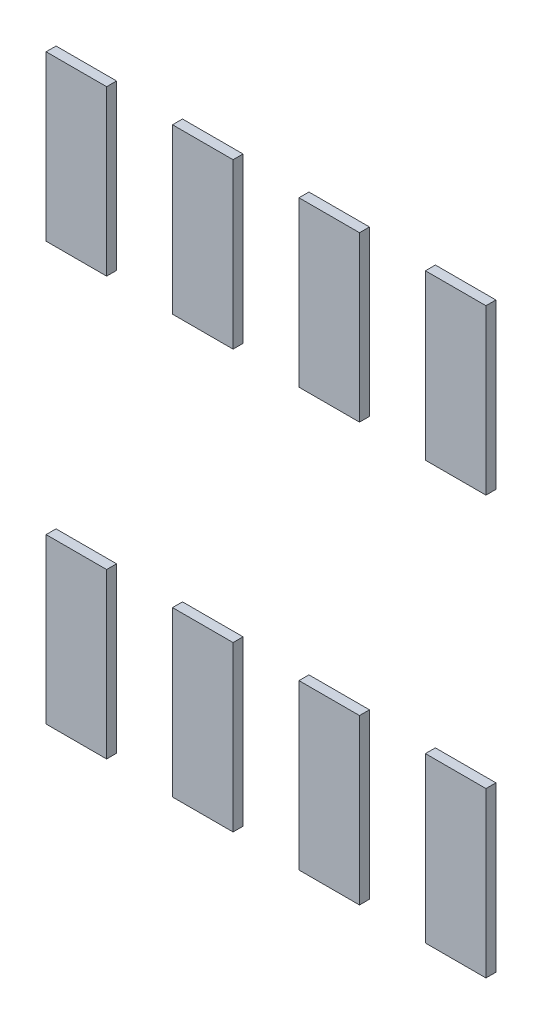
ISO-10303-21;
HEADER;
FILE_DESCRIPTION(('STEP AP214'),'2;1');
FILE_NAME('part.step','',(''),(''),'','','');
FILE_SCHEMA(('AUTOMOTIVE_DESIGN { 1 0 10303 214 1 1 1 1 }'));
ENDSEC;
DATA;
#1=APPLICATION_CONTEXT('core data for automotive mechanical design processes');
#2=APPLICATION_PROTOCOL_DEFINITION('international standard','automotive_design',2000,#1);
#3=PRODUCT_CONTEXT('',#1,'mechanical');
#4=PRODUCT('Part','Part','',(#3));
#5=PRODUCT_RELATED_PRODUCT_CATEGORY('part','',(#4));
#6=PRODUCT_DEFINITION_FORMATION('','',#4);
#7=PRODUCT_DEFINITION_CONTEXT('part definition',#1,'design');
#8=PRODUCT_DEFINITION('design','',#6,#7);
#9=PRODUCT_DEFINITION_SHAPE('','',#8);
#10=(LENGTH_UNIT() NAMED_UNIT(*) SI_UNIT(.MILLI.,.METRE.));
#11=(NAMED_UNIT(*) PLANE_ANGLE_UNIT() SI_UNIT($,.RADIAN.));
#12=(NAMED_UNIT(*) SI_UNIT($,.STERADIAN.) SOLID_ANGLE_UNIT());
#13=UNCERTAINTY_MEASURE_WITH_UNIT(LENGTH_MEASURE(1.E-05),#10,'distance_accuracy_value','');
#14=(GEOMETRIC_REPRESENTATION_CONTEXT(3) GLOBAL_UNCERTAINTY_ASSIGNED_CONTEXT((#13)) GLOBAL_UNIT_ASSIGNED_CONTEXT((#10,
#11,#12)) REPRESENTATION_CONTEXT('',''));
#15=CARTESIAN_POINT('',(0.,0.,0.));
#16=DIRECTION('',(0.,0.,1.));
#17=DIRECTION('',(1.,0.,0.));
#18=AXIS2_PLACEMENT_3D('',#15,#16,#17);
#19=CARTESIAN_POINT('',(-2.209,1.276,0.1));
#20=DIRECTION('',(0.,0.,1.));
#21=DIRECTION('',(1.,0.,0.));
#22=AXIS2_PLACEMENT_3D('',#19,#20,#21);
#23=PLANE('',#22);
#24=DIRECTION('',(0.,1.,0.));
#25=VECTOR('',#24,1.);
#26=CARTESIAN_POINT('',(-2.209,1.276,0.1));
#27=LINE('',#26,#25);
#28=CARTESIAN_POINT('',(-2.209,1.276,0.1));
#29=VERTEX_POINT('',#28);
#30=CARTESIAN_POINT('',(-2.209,2.924,0.1));
#31=VERTEX_POINT('',#30);
#32=EDGE_CURVE('P0_E69',#29,#31,#27,.T.);
#33=ORIENTED_EDGE('',*,*,#32,.F.);
#34=DIRECTION('',(1.,0.,0.));
#35=VECTOR('',#34,1.);
#36=CARTESIAN_POINT('',(-2.209,1.276,0.1));
#37=LINE('',#36,#35);
#38=CARTESIAN_POINT('',(-1.601,1.276,0.1));
#39=VERTEX_POINT('',#38);
#40=EDGE_CURVE('P0_E64',#29,#39,#37,.T.);
#41=ORIENTED_EDGE('',*,*,#40,.T.);
#42=DIRECTION('',(0.,1.,0.));
#43=VECTOR('',#42,1.);
#44=CARTESIAN_POINT('',(-1.601,1.276,0.1));
#45=LINE('',#44,#43);
#46=CARTESIAN_POINT('',(-1.601,2.924,0.1));
#47=VERTEX_POINT('',#46);
#48=EDGE_CURVE('P0_E66',#39,#47,#45,.T.);
#49=ORIENTED_EDGE('',*,*,#48,.T.);
#50=DIRECTION('',(1.,0.,0.));
#51=VECTOR('',#50,1.);
#52=CARTESIAN_POINT('',(-2.209,2.924,0.1));
#53=LINE('',#52,#51);
#54=EDGE_CURVE('P0_E11',#31,#47,#53,.T.);
#55=ORIENTED_EDGE('',*,*,#54,.F.);
#56=EDGE_LOOP('',(#33,#41,#49,#55));
#57=FACE_BOUND('',#56,.T.);
#58=ADVANCED_FACE('P0_F17',(#57),#23,.T.);
#59=CARTESIAN_POINT('',(-2.209,1.276,0.));
#60=DIRECTION('',(0.,0.,1.));
#61=DIRECTION('',(1.,0.,0.));
#62=AXIS2_PLACEMENT_3D('',#59,#60,#61);
#63=PLANE('',#62);
#64=DIRECTION('',(1.,0.,0.));
#65=VECTOR('',#64,1.);
#66=CARTESIAN_POINT('',(-2.209,2.924,0.));
#67=LINE('',#66,#65);
#68=CARTESIAN_POINT('',(-2.209,2.924,0.));
#69=VERTEX_POINT('',#68);
#70=CARTESIAN_POINT('',(-1.601,2.924,0.));
#71=VERTEX_POINT('',#70);
#72=EDGE_CURVE('P0_E26',#69,#71,#67,.T.);
#73=ORIENTED_EDGE('',*,*,#72,.T.);
#74=DIRECTION('',(0.,1.,0.));
#75=VECTOR('',#74,1.);
#76=CARTESIAN_POINT('',(-1.601,1.276,0.));
#77=LINE('',#76,#75);
#78=CARTESIAN_POINT('',(-1.601,1.276,0.));
#79=VERTEX_POINT('',#78);
#80=EDGE_CURVE('P0_E88',#79,#71,#77,.T.);
#81=ORIENTED_EDGE('',*,*,#80,.F.);
#82=DIRECTION('',(1.,0.,0.));
#83=VECTOR('',#82,1.);
#84=CARTESIAN_POINT('',(-2.209,1.276,0.));
#85=LINE('',#84,#83);
#86=CARTESIAN_POINT('',(-2.209,1.276,0.));
#87=VERTEX_POINT('',#86);
#88=EDGE_CURVE('P0_E75',#87,#79,#85,.T.);
#89=ORIENTED_EDGE('',*,*,#88,.F.);
#90=DIRECTION('',(0.,1.,0.));
#91=VECTOR('',#90,1.);
#92=CARTESIAN_POINT('',(-2.209,1.276,0.));
#93=LINE('',#92,#91);
#94=EDGE_CURVE('P0_E97',#87,#69,#93,.T.);
#95=ORIENTED_EDGE('',*,*,#94,.T.);
#96=EDGE_LOOP('',(#73,#81,#89,#95));
#97=FACE_BOUND('',#96,.T.);
#98=ADVANCED_FACE('P0_F124',(#97),#63,.F.);
#99=CARTESIAN_POINT('',(-2.209,2.924,0.));
#100=DIRECTION('',(0.,1.,0.));
#101=DIRECTION('',(1.,0.,0.));
#102=AXIS2_PLACEMENT_3D('',#99,#100,#101);
#103=PLANE('',#102);
#104=ORIENTED_EDGE('',*,*,#72,.F.);
#105=DIRECTION('',(0.,0.,1.));
#106=VECTOR('',#105,1.);
#107=CARTESIAN_POINT('',(-2.209,2.924,0.));
#108=LINE('',#107,#106);
#109=EDGE_CURVE('P0_E113',#69,#31,#108,.T.);
#110=ORIENTED_EDGE('',*,*,#109,.T.);
#111=ORIENTED_EDGE('',*,*,#54,.T.);
#112=DIRECTION('',(0.,0.,1.));
#113=VECTOR('',#112,1.);
#114=CARTESIAN_POINT('',(-1.601,2.924,0.));
#115=LINE('',#114,#113);
#116=EDGE_CURVE('P0_E82',#71,#47,#115,.T.);
#117=ORIENTED_EDGE('',*,*,#116,.F.);
#118=EDGE_LOOP('',(#104,#110,#111,#117));
#119=FACE_BOUND('',#118,.T.);
#120=ADVANCED_FACE('P0_F120',(#119),#103,.T.);
#121=CARTESIAN_POINT('',(-2.209,1.276,0.));
#122=DIRECTION('',(0.,1.,0.));
#123=DIRECTION('',(1.,0.,0.));
#124=AXIS2_PLACEMENT_3D('',#121,#122,#123);
#125=PLANE('',#124);
#126=DIRECTION('',(0.,0.,1.));
#127=VECTOR('',#126,1.);
#128=CARTESIAN_POINT('',(-1.601,1.276,0.));
#129=LINE('',#128,#127);
#130=EDGE_CURVE('P0_E81',#79,#39,#129,.T.);
#131=ORIENTED_EDGE('',*,*,#130,.T.);
#132=ORIENTED_EDGE('',*,*,#40,.F.);
#133=DIRECTION('',(0.,0.,1.));
#134=VECTOR('',#133,1.);
#135=CARTESIAN_POINT('',(-2.209,1.276,0.));
#136=LINE('',#135,#134);
#137=EDGE_CURVE('P0_E89',#87,#29,#136,.T.);
#138=ORIENTED_EDGE('',*,*,#137,.F.);
#139=ORIENTED_EDGE('',*,*,#88,.T.);
#140=EDGE_LOOP('',(#131,#132,#138,#139));
#141=FACE_BOUND('',#140,.T.);
#142=ADVANCED_FACE('P0_F85',(#141),#125,.F.);
#143=CARTESIAN_POINT('',(-1.601,1.276,0.));
#144=DIRECTION('',(1.,0.,0.));
#145=DIRECTION('',(0.,1.,0.));
#146=AXIS2_PLACEMENT_3D('',#143,#144,#145);
#147=PLANE('',#146);
#148=ORIENTED_EDGE('',*,*,#130,.F.);
#149=ORIENTED_EDGE('',*,*,#80,.T.);
#150=ORIENTED_EDGE('',*,*,#116,.T.);
#151=ORIENTED_EDGE('',*,*,#48,.F.);
#152=EDGE_LOOP('',(#148,#149,#150,#151));
#153=FACE_BOUND('',#152,.T.);
#154=ADVANCED_FACE('P0_F79',(#153),#147,.T.);
#155=CARTESIAN_POINT('',(-2.209,1.276,0.));
#156=DIRECTION('',(1.,0.,0.));
#157=DIRECTION('',(0.,1.,0.));
#158=AXIS2_PLACEMENT_3D('',#155,#156,#157);
#159=PLANE('',#158);
#160=ORIENTED_EDGE('',*,*,#32,.T.);
#161=ORIENTED_EDGE('',*,*,#109,.F.);
#162=ORIENTED_EDGE('',*,*,#94,.F.);
#163=ORIENTED_EDGE('',*,*,#137,.T.);
#164=EDGE_LOOP('',(#160,#161,#162,#163));
#165=FACE_BOUND('',#164,.T.);
#166=ADVANCED_FACE('P0_F123',(#165),#159,.F.);
#167=CLOSED_SHELL('',(#58,#98,#120,#142,#154,#166));
#168=MANIFOLD_SOLID_BREP('P0_B1',#167);
#169=CARTESIAN_POINT('',(-2.209,-2.924,0.1));
#170=DIRECTION('',(0.,0.,1.));
#171=DIRECTION('',(1.,0.,0.));
#172=AXIS2_PLACEMENT_3D('',#169,#170,#171);
#173=PLANE('',#172);
#174=DIRECTION('',(0.,1.,0.));
#175=VECTOR('',#174,1.);
#176=CARTESIAN_POINT('',(-2.209,-2.924,0.1));
#177=LINE('',#176,#175);
#178=CARTESIAN_POINT('',(-2.209,-2.924,0.1));
#179=VERTEX_POINT('',#178);
#180=CARTESIAN_POINT('',(-2.209,-1.276,0.1));
#181=VERTEX_POINT('',#180);
#182=EDGE_CURVE('P1_E88',#179,#181,#177,.T.);
#183=ORIENTED_EDGE('',*,*,#182,.F.);
#184=DIRECTION('',(1.,0.,0.));
#185=VECTOR('',#184,1.);
#186=CARTESIAN_POINT('',(-2.209,-2.924,0.1));
#187=LINE('',#186,#185);
#188=CARTESIAN_POINT('',(-1.601,-2.924,0.1));
#189=VERTEX_POINT('',#188);
#190=EDGE_CURVE('P1_E99',#179,#189,#187,.T.);
#191=ORIENTED_EDGE('',*,*,#190,.T.);
#192=DIRECTION('',(0.,1.,0.));
#193=VECTOR('',#192,1.);
#194=CARTESIAN_POINT('',(-1.601,-2.924,0.1));
#195=LINE('',#194,#193);
#196=CARTESIAN_POINT('',(-1.601,-1.276,0.1));
#197=VERTEX_POINT('',#196);
#198=EDGE_CURVE('P1_E111',#189,#197,#195,.T.);
#199=ORIENTED_EDGE('',*,*,#198,.T.);
#200=DIRECTION('',(1.,0.,0.));
#201=VECTOR('',#200,1.);
#202=CARTESIAN_POINT('',(-2.209,-1.276,0.1));
#203=LINE('',#202,#201);
#204=EDGE_CURVE('P1_E11',#181,#197,#203,.T.);
#205=ORIENTED_EDGE('',*,*,#204,.F.);
#206=EDGE_LOOP('',(#183,#191,#199,#205));
#207=FACE_BOUND('',#206,.T.);
#208=ADVANCED_FACE('P1_F17',(#207),#173,.T.);
#209=CARTESIAN_POINT('',(-2.209,-2.924,0.));
#210=DIRECTION('',(0.,0.,1.));
#211=DIRECTION('',(1.,0.,0.));
#212=AXIS2_PLACEMENT_3D('',#209,#210,#211);
#213=PLANE('',#212);
#214=DIRECTION('',(1.,0.,0.));
#215=VECTOR('',#214,1.);
#216=CARTESIAN_POINT('',(-2.209,-1.276,0.));
#217=LINE('',#216,#215);
#218=CARTESIAN_POINT('',(-2.209,-1.276,0.));
#219=VERTEX_POINT('',#218);
#220=CARTESIAN_POINT('',(-1.601,-1.276,0.));
#221=VERTEX_POINT('',#220);
#222=EDGE_CURVE('P1_E20',#219,#221,#217,.T.);
#223=ORIENTED_EDGE('',*,*,#222,.T.);
#224=DIRECTION('',(0.,1.,0.));
#225=VECTOR('',#224,1.);
#226=CARTESIAN_POINT('',(-1.601,-2.924,0.));
#227=LINE('',#226,#225);
#228=CARTESIAN_POINT('',(-1.601,-2.924,0.));
#229=VERTEX_POINT('',#228);
#230=EDGE_CURVE('P1_E104',#229,#221,#227,.T.);
#231=ORIENTED_EDGE('',*,*,#230,.F.);
#232=DIRECTION('',(1.,0.,0.));
#233=VECTOR('',#232,1.);
#234=CARTESIAN_POINT('',(-2.209,-2.924,0.));
#235=LINE('',#234,#233);
#236=CARTESIAN_POINT('',(-2.209,-2.924,0.));
#237=VERTEX_POINT('',#236);
#238=EDGE_CURVE('P1_E76',#237,#229,#235,.T.);
#239=ORIENTED_EDGE('',*,*,#238,.F.);
#240=DIRECTION('',(0.,1.,0.));
#241=VECTOR('',#240,1.);
#242=CARTESIAN_POINT('',(-2.209,-2.924,0.));
#243=LINE('',#242,#241);
#244=EDGE_CURVE('P1_E78',#237,#219,#243,.T.);
#245=ORIENTED_EDGE('',*,*,#244,.T.);
#246=EDGE_LOOP('',(#223,#231,#239,#245));
#247=FACE_BOUND('',#246,.T.);
#248=ADVANCED_FACE('P1_F79',(#247),#213,.F.);
#249=CARTESIAN_POINT('',(-2.209,-1.276,0.));
#250=DIRECTION('',(0.,1.,0.));
#251=DIRECTION('',(1.,0.,0.));
#252=AXIS2_PLACEMENT_3D('',#249,#250,#251);
#253=PLANE('',#252);
#254=ORIENTED_EDGE('',*,*,#222,.F.);
#255=DIRECTION('',(0.,0.,1.));
#256=VECTOR('',#255,1.);
#257=CARTESIAN_POINT('',(-2.209,-1.276,0.));
#258=LINE('',#257,#256);
#259=EDGE_CURVE('P1_E70',#219,#181,#258,.T.);
#260=ORIENTED_EDGE('',*,*,#259,.T.);
#261=ORIENTED_EDGE('',*,*,#204,.T.);
#262=DIRECTION('',(0.,0.,1.));
#263=VECTOR('',#262,1.);
#264=CARTESIAN_POINT('',(-1.601,-1.276,0.));
#265=LINE('',#264,#263);
#266=EDGE_CURVE('P1_E73',#221,#197,#265,.T.);
#267=ORIENTED_EDGE('',*,*,#266,.F.);
#268=EDGE_LOOP('',(#254,#260,#261,#267));
#269=FACE_BOUND('',#268,.T.);
#270=ADVANCED_FACE('P1_F68',(#269),#253,.T.);
#271=CARTESIAN_POINT('',(-2.209,-2.924,0.));
#272=DIRECTION('',(0.,1.,0.));
#273=DIRECTION('',(1.,0.,0.));
#274=AXIS2_PLACEMENT_3D('',#271,#272,#273);
#275=PLANE('',#274);
#276=DIRECTION('',(0.,0.,1.));
#277=VECTOR('',#276,1.);
#278=CARTESIAN_POINT('',(-1.601,-2.924,0.));
#279=LINE('',#278,#277);
#280=EDGE_CURVE('P1_E100',#229,#189,#279,.T.);
#281=ORIENTED_EDGE('',*,*,#280,.T.);
#282=ORIENTED_EDGE('',*,*,#190,.F.);
#283=DIRECTION('',(0.,0.,1.));
#284=VECTOR('',#283,1.);
#285=CARTESIAN_POINT('',(-2.209,-2.924,0.));
#286=LINE('',#285,#284);
#287=EDGE_CURVE('P1_E84',#237,#179,#286,.T.);
#288=ORIENTED_EDGE('',*,*,#287,.F.);
#289=ORIENTED_EDGE('',*,*,#238,.T.);
#290=EDGE_LOOP('',(#281,#282,#288,#289));
#291=FACE_BOUND('',#290,.T.);
#292=ADVANCED_FACE('P1_F122',(#291),#275,.F.);
#293=CARTESIAN_POINT('',(-1.601,-2.924,0.));
#294=DIRECTION('',(1.,0.,0.));
#295=DIRECTION('',(0.,1.,0.));
#296=AXIS2_PLACEMENT_3D('',#293,#294,#295);
#297=PLANE('',#296);
#298=ORIENTED_EDGE('',*,*,#280,.F.);
#299=ORIENTED_EDGE('',*,*,#230,.T.);
#300=ORIENTED_EDGE('',*,*,#266,.T.);
#301=ORIENTED_EDGE('',*,*,#198,.F.);
#302=EDGE_LOOP('',(#298,#299,#300,#301));
#303=FACE_BOUND('',#302,.T.);
#304=ADVANCED_FACE('P1_F121',(#303),#297,.T.);
#305=CARTESIAN_POINT('',(-2.209,-2.924,0.));
#306=DIRECTION('',(1.,0.,0.));
#307=DIRECTION('',(0.,1.,0.));
#308=AXIS2_PLACEMENT_3D('',#305,#306,#307);
#309=PLANE('',#308);
#310=ORIENTED_EDGE('',*,*,#182,.T.);
#311=ORIENTED_EDGE('',*,*,#259,.F.);
#312=ORIENTED_EDGE('',*,*,#244,.F.);
#313=ORIENTED_EDGE('',*,*,#287,.T.);
#314=EDGE_LOOP('',(#310,#311,#312,#313));
#315=FACE_BOUND('',#314,.T.);
#316=ADVANCED_FACE('P1_F86',(#315),#309,.F.);
#317=CLOSED_SHELL('',(#208,#248,#270,#292,#304,#316));
#318=MANIFOLD_SOLID_BREP('P1_B1',#317);
#319=CARTESIAN_POINT('',(-0.939,1.276,0.1));
#320=DIRECTION('',(0.,0.,1.));
#321=DIRECTION('',(1.,0.,0.));
#322=AXIS2_PLACEMENT_3D('',#319,#320,#321);
#323=PLANE('',#322);
#324=DIRECTION('',(0.,1.,0.));
#325=VECTOR('',#324,1.);
#326=CARTESIAN_POINT('',(-0.939,1.276,0.1));
#327=LINE('',#326,#325);
#328=CARTESIAN_POINT('',(-0.939,1.276,0.1));
#329=VERTEX_POINT('',#328);
#330=CARTESIAN_POINT('',(-0.939,2.924,0.1));
#331=VERTEX_POINT('',#330);
#332=EDGE_CURVE('P2_E87',#329,#331,#327,.T.);
#333=ORIENTED_EDGE('',*,*,#332,.F.);
#334=DIRECTION('',(1.,0.,0.));
#335=VECTOR('',#334,1.);
#336=CARTESIAN_POINT('',(-0.939,1.276,0.1));
#337=LINE('',#336,#335);
#338=CARTESIAN_POINT('',(-0.331,1.276,0.1));
#339=VERTEX_POINT('',#338);
#340=EDGE_CURVE('P2_E69',#329,#339,#337,.T.);
#341=ORIENTED_EDGE('',*,*,#340,.T.);
#342=DIRECTION('',(0.,1.,0.));
#343=VECTOR('',#342,1.);
#344=CARTESIAN_POINT('',(-0.331,1.276,0.1));
#345=LINE('',#344,#343);
#346=CARTESIAN_POINT('',(-0.331,2.924,0.1));
#347=VERTEX_POINT('',#346);
#348=EDGE_CURVE('P2_E81',#339,#347,#345,.T.);
#349=ORIENTED_EDGE('',*,*,#348,.T.);
#350=DIRECTION('',(1.,0.,0.));
#351=VECTOR('',#350,1.);
#352=CARTESIAN_POINT('',(-0.939,2.924,0.1));
#353=LINE('',#352,#351);
#354=EDGE_CURVE('P2_E11',#331,#347,#353,.T.);
#355=ORIENTED_EDGE('',*,*,#354,.F.);
#356=EDGE_LOOP('',(#333,#341,#349,#355));
#357=FACE_BOUND('',#356,.T.);
#358=ADVANCED_FACE('P2_F17',(#357),#323,.T.);
#359=CARTESIAN_POINT('',(-0.939,1.276,0.));
#360=DIRECTION('',(0.,0.,1.));
#361=DIRECTION('',(1.,0.,0.));
#362=AXIS2_PLACEMENT_3D('',#359,#360,#361);
#363=PLANE('',#362);
#364=DIRECTION('',(1.,0.,0.));
#365=VECTOR('',#364,1.);
#366=CARTESIAN_POINT('',(-0.939,2.924,0.));
#367=LINE('',#366,#365);
#368=CARTESIAN_POINT('',(-0.939,2.924,0.));
#369=VERTEX_POINT('',#368);
#370=CARTESIAN_POINT('',(-0.331,2.924,0.));
#371=VERTEX_POINT('',#370);
#372=EDGE_CURVE('P2_E25',#369,#371,#367,.T.);
#373=ORIENTED_EDGE('',*,*,#372,.T.);
#374=DIRECTION('',(0.,1.,0.));
#375=VECTOR('',#374,1.);
#376=CARTESIAN_POINT('',(-0.331,1.276,0.));
#377=LINE('',#376,#375);
#378=CARTESIAN_POINT('',(-0.331,1.276,0.));
#379=VERTEX_POINT('',#378);
#380=EDGE_CURVE('P2_E104',#379,#371,#377,.T.);
#381=ORIENTED_EDGE('',*,*,#380,.F.);
#382=DIRECTION('',(1.,0.,0.));
#383=VECTOR('',#382,1.);
#384=CARTESIAN_POINT('',(-0.939,1.276,0.));
#385=LINE('',#384,#383);
#386=CARTESIAN_POINT('',(-0.939,1.276,0.));
#387=VERTEX_POINT('',#386);
#388=EDGE_CURVE('P2_E80',#387,#379,#385,.T.);
#389=ORIENTED_EDGE('',*,*,#388,.F.);
#390=DIRECTION('',(0.,1.,0.));
#391=VECTOR('',#390,1.);
#392=CARTESIAN_POINT('',(-0.939,1.276,0.));
#393=LINE('',#392,#391);
#394=EDGE_CURVE('P2_E88',#387,#369,#393,.T.);
#395=ORIENTED_EDGE('',*,*,#394,.T.);
#396=EDGE_LOOP('',(#373,#381,#389,#395));
#397=FACE_BOUND('',#396,.T.);
#398=ADVANCED_FACE('P2_F191',(#397),#363,.F.);
#399=CARTESIAN_POINT('',(-0.939,2.924,0.));
#400=DIRECTION('',(0.,1.,0.));
#401=DIRECTION('',(1.,0.,0.));
#402=AXIS2_PLACEMENT_3D('',#399,#400,#401);
#403=PLANE('',#402);
#404=ORIENTED_EDGE('',*,*,#372,.F.);
#405=DIRECTION('',(0.,0.,1.));
#406=VECTOR('',#405,1.);
#407=CARTESIAN_POINT('',(-0.939,2.924,0.));
#408=LINE('',#407,#406);
#409=EDGE_CURVE('P2_E92',#369,#331,#408,.T.);
#410=ORIENTED_EDGE('',*,*,#409,.T.);
#411=ORIENTED_EDGE('',*,*,#354,.T.);
#412=DIRECTION('',(0.,0.,1.));
#413=VECTOR('',#412,1.);
#414=CARTESIAN_POINT('',(-0.331,2.924,0.));
#415=LINE('',#414,#413);
#416=EDGE_CURVE('P2_E108',#371,#347,#415,.T.);
#417=ORIENTED_EDGE('',*,*,#416,.F.);
#418=EDGE_LOOP('',(#404,#410,#411,#417));
#419=FACE_BOUND('',#418,.T.);
#420=ADVANCED_FACE('P2_F181',(#419),#403,.T.);
#421=CARTESIAN_POINT('',(-0.939,1.276,0.));
#422=DIRECTION('',(0.,1.,0.));
#423=DIRECTION('',(1.,0.,0.));
#424=AXIS2_PLACEMENT_3D('',#421,#422,#423);
#425=PLANE('',#424);
#426=DIRECTION('',(0.,0.,1.));
#427=VECTOR('',#426,1.);
#428=CARTESIAN_POINT('',(-0.331,1.276,0.));
#429=LINE('',#428,#427);
#430=EDGE_CURVE('P2_E75',#379,#339,#429,.T.);
#431=ORIENTED_EDGE('',*,*,#430,.T.);
#432=ORIENTED_EDGE('',*,*,#340,.F.);
#433=DIRECTION('',(0.,0.,1.));
#434=VECTOR('',#433,1.);
#435=CARTESIAN_POINT('',(-0.939,1.276,0.));
#436=LINE('',#435,#434);
#437=EDGE_CURVE('P2_E72',#387,#329,#436,.T.);
#438=ORIENTED_EDGE('',*,*,#437,.F.);
#439=ORIENTED_EDGE('',*,*,#388,.T.);
#440=EDGE_LOOP('',(#431,#432,#438,#439));
#441=FACE_BOUND('',#440,.T.);
#442=ADVANCED_FACE('P2_F71',(#441),#425,.F.);
#443=CARTESIAN_POINT('',(-0.331,1.276,0.));
#444=DIRECTION('',(1.,0.,0.));
#445=DIRECTION('',(0.,1.,0.));
#446=AXIS2_PLACEMENT_3D('',#443,#444,#445);
#447=PLANE('',#446);
#448=ORIENTED_EDGE('',*,*,#430,.F.);
#449=ORIENTED_EDGE('',*,*,#380,.T.);
#450=ORIENTED_EDGE('',*,*,#416,.T.);
#451=ORIENTED_EDGE('',*,*,#348,.F.);
#452=EDGE_LOOP('',(#448,#449,#450,#451));
#453=FACE_BOUND('',#452,.T.);
#454=ADVANCED_FACE('P2_F159',(#453),#447,.T.);
#455=CARTESIAN_POINT('',(-0.939,1.276,0.));
#456=DIRECTION('',(1.,0.,0.));
#457=DIRECTION('',(0.,1.,0.));
#458=AXIS2_PLACEMENT_3D('',#455,#456,#457);
#459=PLANE('',#458);
#460=ORIENTED_EDGE('',*,*,#332,.T.);
#461=ORIENTED_EDGE('',*,*,#409,.F.);
#462=ORIENTED_EDGE('',*,*,#394,.F.);
#463=ORIENTED_EDGE('',*,*,#437,.T.);
#464=EDGE_LOOP('',(#460,#461,#462,#463));
#465=FACE_BOUND('',#464,.T.);
#466=ADVANCED_FACE('P2_F85',(#465),#459,.F.);
#467=CLOSED_SHELL('',(#358,#398,#420,#442,#454,#466));
#468=MANIFOLD_SOLID_BREP('P2_B1',#467);
#469=CARTESIAN_POINT('',(-0.939,-2.924,0.1));
#470=DIRECTION('',(0.,0.,1.));
#471=DIRECTION('',(1.,0.,0.));
#472=AXIS2_PLACEMENT_3D('',#469,#470,#471);
#473=PLANE('',#472);
#474=DIRECTION('',(0.,1.,0.));
#475=VECTOR('',#474,1.);
#476=CARTESIAN_POINT('',(-0.939,-2.924,0.1));
#477=LINE('',#476,#475);
#478=CARTESIAN_POINT('',(-0.939,-2.924,0.1));
#479=VERTEX_POINT('',#478);
#480=CARTESIAN_POINT('',(-0.939,-1.276,0.1));
#481=VERTEX_POINT('',#480);
#482=EDGE_CURVE('P3_E67',#479,#481,#477,.T.);
#483=ORIENTED_EDGE('',*,*,#482,.F.);
#484=DIRECTION('',(1.,0.,0.));
#485=VECTOR('',#484,1.);
#486=CARTESIAN_POINT('',(-0.939,-2.924,0.1));
#487=LINE('',#486,#485);
#488=CARTESIAN_POINT('',(-0.331,-2.924,0.1));
#489=VERTEX_POINT('',#488);
#490=EDGE_CURVE('P3_E61',#479,#489,#487,.T.);
#491=ORIENTED_EDGE('',*,*,#490,.T.);
#492=DIRECTION('',(0.,1.,0.));
#493=VECTOR('',#492,1.);
#494=CARTESIAN_POINT('',(-0.331,-2.924,0.1));
#495=LINE('',#494,#493);
#496=CARTESIAN_POINT('',(-0.331,-1.276,0.1));
#497=VERTEX_POINT('',#496);
#498=EDGE_CURVE('P3_E63',#489,#497,#495,.T.);
#499=ORIENTED_EDGE('',*,*,#498,.T.);
#500=DIRECTION('',(1.,0.,0.));
#501=VECTOR('',#500,1.);
#502=CARTESIAN_POINT('',(-0.939,-1.276,0.1));
#503=LINE('',#502,#501);
#504=EDGE_CURVE('P3_E11',#481,#497,#503,.T.);
#505=ORIENTED_EDGE('',*,*,#504,.F.);
#506=EDGE_LOOP('',(#483,#491,#499,#505));
#507=FACE_BOUND('',#506,.T.);
#508=ADVANCED_FACE('P3_F17',(#507),#473,.T.);
#509=CARTESIAN_POINT('',(-0.939,-2.924,0.));
#510=DIRECTION('',(0.,0.,1.));
#511=DIRECTION('',(1.,0.,0.));
#512=AXIS2_PLACEMENT_3D('',#509,#510,#511);
#513=PLANE('',#512);
#514=DIRECTION('',(1.,0.,0.));
#515=VECTOR('',#514,1.);
#516=CARTESIAN_POINT('',(-0.939,-1.276,0.));
#517=LINE('',#516,#515);
#518=CARTESIAN_POINT('',(-0.939,-1.276,0.));
#519=VERTEX_POINT('',#518);
#520=CARTESIAN_POINT('',(-0.331,-1.276,0.));
#521=VERTEX_POINT('',#520);
#522=EDGE_CURVE('P3_E26',#519,#521,#517,.T.);
#523=ORIENTED_EDGE('',*,*,#522,.T.);
#524=DIRECTION('',(0.,1.,0.));
#525=VECTOR('',#524,1.);
#526=CARTESIAN_POINT('',(-0.331,-2.924,0.));
#527=LINE('',#526,#525);
#528=CARTESIAN_POINT('',(-0.331,-2.924,0.));
#529=VERTEX_POINT('',#528);
#530=EDGE_CURVE('P3_E86',#529,#521,#527,.T.);
#531=ORIENTED_EDGE('',*,*,#530,.F.);
#532=DIRECTION('',(1.,0.,0.));
#533=VECTOR('',#532,1.);
#534=CARTESIAN_POINT('',(-0.939,-2.924,0.));
#535=LINE('',#534,#533);
#536=CARTESIAN_POINT('',(-0.939,-2.924,0.));
#537=VERTEX_POINT('',#536);
#538=EDGE_CURVE('P3_E73',#537,#529,#535,.T.);
#539=ORIENTED_EDGE('',*,*,#538,.F.);
#540=DIRECTION('',(0.,1.,0.));
#541=VECTOR('',#540,1.);
#542=CARTESIAN_POINT('',(-0.939,-2.924,0.));
#543=LINE('',#542,#541);
#544=EDGE_CURVE('P3_E95',#537,#519,#543,.T.);
#545=ORIENTED_EDGE('',*,*,#544,.T.);
#546=EDGE_LOOP('',(#523,#531,#539,#545));
#547=FACE_BOUND('',#546,.T.);
#548=ADVANCED_FACE('P3_F107',(#547),#513,.F.);
#549=CARTESIAN_POINT('',(-0.939,-1.276,0.));
#550=DIRECTION('',(0.,1.,0.));
#551=DIRECTION('',(1.,0.,0.));
#552=AXIS2_PLACEMENT_3D('',#549,#550,#551);
#553=PLANE('',#552);
#554=ORIENTED_EDGE('',*,*,#522,.F.);
#555=DIRECTION('',(0.,0.,1.));
#556=VECTOR('',#555,1.);
#557=CARTESIAN_POINT('',(-0.939,-1.276,0.));
#558=LINE('',#557,#556);
#559=EDGE_CURVE('P3_E200',#519,#481,#558,.T.);
#560=ORIENTED_EDGE('',*,*,#559,.T.);
#561=ORIENTED_EDGE('',*,*,#504,.T.);
#562=DIRECTION('',(0.,0.,1.));
#563=VECTOR('',#562,1.);
#564=CARTESIAN_POINT('',(-0.331,-1.276,0.));
#565=LINE('',#564,#563);
#566=EDGE_CURVE('P3_E80',#521,#497,#565,.T.);
#567=ORIENTED_EDGE('',*,*,#566,.F.);
#568=EDGE_LOOP('',(#554,#560,#561,#567));
#569=FACE_BOUND('',#568,.T.);
#570=ADVANCED_FACE('P3_F110',(#569),#553,.T.);
#571=CARTESIAN_POINT('',(-0.939,-2.924,0.));
#572=DIRECTION('',(0.,1.,0.));
#573=DIRECTION('',(1.,0.,0.));
#574=AXIS2_PLACEMENT_3D('',#571,#572,#573);
#575=PLANE('',#574);
#576=DIRECTION('',(0.,0.,1.));
#577=VECTOR('',#576,1.);
#578=CARTESIAN_POINT('',(-0.331,-2.924,0.));
#579=LINE('',#578,#577);
#580=EDGE_CURVE('P3_E79',#529,#489,#579,.T.);
#581=ORIENTED_EDGE('',*,*,#580,.T.);
#582=ORIENTED_EDGE('',*,*,#490,.F.);
#583=DIRECTION('',(0.,0.,1.));
#584=VECTOR('',#583,1.);
#585=CARTESIAN_POINT('',(-0.939,-2.924,0.));
#586=LINE('',#585,#584);
#587=EDGE_CURVE('P3_E87',#537,#479,#586,.T.);
#588=ORIENTED_EDGE('',*,*,#587,.F.);
#589=ORIENTED_EDGE('',*,*,#538,.T.);
#590=EDGE_LOOP('',(#581,#582,#588,#589));
#591=FACE_BOUND('',#590,.T.);
#592=ADVANCED_FACE('P3_F83',(#591),#575,.F.);
#593=CARTESIAN_POINT('',(-0.331,-2.924,0.));
#594=DIRECTION('',(1.,0.,0.));
#595=DIRECTION('',(0.,1.,0.));
#596=AXIS2_PLACEMENT_3D('',#593,#594,#595);
#597=PLANE('',#596);
#598=ORIENTED_EDGE('',*,*,#580,.F.);
#599=ORIENTED_EDGE('',*,*,#530,.T.);
#600=ORIENTED_EDGE('',*,*,#566,.T.);
#601=ORIENTED_EDGE('',*,*,#498,.F.);
#602=EDGE_LOOP('',(#598,#599,#600,#601));
#603=FACE_BOUND('',#602,.T.);
#604=ADVANCED_FACE('P3_F77',(#603),#597,.T.);
#605=CARTESIAN_POINT('',(-0.939,-2.924,0.));
#606=DIRECTION('',(1.,0.,0.));
#607=DIRECTION('',(0.,1.,0.));
#608=AXIS2_PLACEMENT_3D('',#605,#606,#607);
#609=PLANE('',#608);
#610=ORIENTED_EDGE('',*,*,#482,.T.);
#611=ORIENTED_EDGE('',*,*,#559,.F.);
#612=ORIENTED_EDGE('',*,*,#544,.F.);
#613=ORIENTED_EDGE('',*,*,#587,.T.);
#614=EDGE_LOOP('',(#610,#611,#612,#613));
#615=FACE_BOUND('',#614,.T.);
#616=ADVANCED_FACE('P3_F155',(#615),#609,.F.);
#617=CLOSED_SHELL('',(#508,#548,#570,#592,#604,#616));
#618=MANIFOLD_SOLID_BREP('P3_B1',#617);
#619=CARTESIAN_POINT('',(0.331,1.276,0.1));
#620=DIRECTION('',(0.,0.,1.));
#621=DIRECTION('',(1.,0.,0.));
#622=AXIS2_PLACEMENT_3D('',#619,#620,#621);
#623=PLANE('',#622);
#624=DIRECTION('',(0.,1.,0.));
#625=VECTOR('',#624,1.);
#626=CARTESIAN_POINT('',(0.331,1.276,0.1));
#627=LINE('',#626,#625);
#628=CARTESIAN_POINT('',(0.331,1.276,0.1));
#629=VERTEX_POINT('',#628);
#630=CARTESIAN_POINT('',(0.331,2.924,0.1));
#631=VERTEX_POINT('',#630);
#632=EDGE_CURVE('P4_E98',#629,#631,#627,.T.);
#633=ORIENTED_EDGE('',*,*,#632,.F.);
#634=DIRECTION('',(1.,0.,0.));
#635=VECTOR('',#634,1.);
#636=CARTESIAN_POINT('',(0.331,1.276,0.1));
#637=LINE('',#636,#635);
#638=CARTESIAN_POINT('',(0.939,1.276,0.1));
#639=VERTEX_POINT('',#638);
#640=EDGE_CURVE('P4_E80',#629,#639,#637,.T.);
#641=ORIENTED_EDGE('',*,*,#640,.T.);
#642=DIRECTION('',(0.,1.,0.));
#643=VECTOR('',#642,1.);
#644=CARTESIAN_POINT('',(0.939,1.276,0.1));
#645=LINE('',#644,#643);
#646=CARTESIAN_POINT('',(0.939,2.924,0.1));
#647=VERTEX_POINT('',#646);
#648=EDGE_CURVE('P4_E110',#639,#647,#645,.T.);
#649=ORIENTED_EDGE('',*,*,#648,.T.);
#650=DIRECTION('',(1.,0.,0.));
#651=VECTOR('',#650,1.);
#652=CARTESIAN_POINT('',(0.331,2.924,0.1));
#653=LINE('',#652,#651);
#654=EDGE_CURVE('P4_E11',#631,#647,#653,.T.);
#655=ORIENTED_EDGE('',*,*,#654,.F.);
#656=EDGE_LOOP('',(#633,#641,#649,#655));
#657=FACE_BOUND('',#656,.T.);
#658=ADVANCED_FACE('P4_F17',(#657),#623,.T.);
#659=CARTESIAN_POINT('',(0.331,1.276,0.));
#660=DIRECTION('',(0.,0.,1.));
#661=DIRECTION('',(1.,0.,0.));
#662=AXIS2_PLACEMENT_3D('',#659,#660,#661);
#663=PLANE('',#662);
#664=DIRECTION('',(1.,0.,0.));
#665=VECTOR('',#664,1.);
#666=CARTESIAN_POINT('',(0.331,2.924,0.));
#667=LINE('',#666,#665);
#668=CARTESIAN_POINT('',(0.331,2.924,0.));
#669=VERTEX_POINT('',#668);
#670=CARTESIAN_POINT('',(0.939,2.924,0.));
#671=VERTEX_POINT('',#670);
#672=EDGE_CURVE('P4_E20',#669,#671,#667,.T.);
#673=ORIENTED_EDGE('',*,*,#672,.T.);
#674=DIRECTION('',(0.,1.,0.));
#675=VECTOR('',#674,1.);
#676=CARTESIAN_POINT('',(0.939,1.276,0.));
#677=LINE('',#676,#675);
#678=CARTESIAN_POINT('',(0.939,1.276,0.));
#679=VERTEX_POINT('',#678);
#680=EDGE_CURVE('P4_E75',#679,#671,#677,.T.);
#681=ORIENTED_EDGE('',*,*,#680,.F.);
#682=DIRECTION('',(1.,0.,0.));
#683=VECTOR('',#682,1.);
#684=CARTESIAN_POINT('',(0.331,1.276,0.));
#685=LINE('',#684,#683);
#686=CARTESIAN_POINT('',(0.331,1.276,0.));
#687=VERTEX_POINT('',#686);
#688=EDGE_CURVE('P4_E68',#687,#679,#685,.T.);
#689=ORIENTED_EDGE('',*,*,#688,.F.);
#690=DIRECTION('',(0.,1.,0.));
#691=VECTOR('',#690,1.);
#692=CARTESIAN_POINT('',(0.331,1.276,0.));
#693=LINE('',#692,#691);
#694=EDGE_CURVE('P4_E72',#687,#669,#693,.T.);
#695=ORIENTED_EDGE('',*,*,#694,.T.);
#696=EDGE_LOOP('',(#673,#681,#689,#695));
#697=FACE_BOUND('',#696,.T.);
#698=ADVANCED_FACE('P4_F70',(#697),#663,.F.);
#699=CARTESIAN_POINT('',(0.331,2.924,0.));
#700=DIRECTION('',(0.,1.,0.));
#701=DIRECTION('',(1.,0.,0.));
#702=AXIS2_PLACEMENT_3D('',#699,#700,#701);
#703=PLANE('',#702);
#704=ORIENTED_EDGE('',*,*,#672,.F.);
#705=DIRECTION('',(0.,0.,1.));
#706=VECTOR('',#705,1.);
#707=CARTESIAN_POINT('',(0.331,2.924,0.));
#708=LINE('',#707,#706);
#709=EDGE_CURVE('P4_E91',#669,#631,#708,.T.);
#710=ORIENTED_EDGE('',*,*,#709,.T.);
#711=ORIENTED_EDGE('',*,*,#654,.T.);
#712=DIRECTION('',(0.,0.,1.));
#713=VECTOR('',#712,1.);
#714=CARTESIAN_POINT('',(0.939,2.924,0.));
#715=LINE('',#714,#713);
#716=EDGE_CURVE('P4_E103',#671,#647,#715,.T.);
#717=ORIENTED_EDGE('',*,*,#716,.F.);
#718=EDGE_LOOP('',(#704,#710,#711,#717));
#719=FACE_BOUND('',#718,.T.);
#720=ADVANCED_FACE('P4_F120',(#719),#703,.T.);
#721=CARTESIAN_POINT('',(0.331,1.276,0.));
#722=DIRECTION('',(0.,1.,0.));
#723=DIRECTION('',(1.,0.,0.));
#724=AXIS2_PLACEMENT_3D('',#721,#722,#723);
#725=PLANE('',#724);
#726=DIRECTION('',(0.,0.,1.));
#727=VECTOR('',#726,1.);
#728=CARTESIAN_POINT('',(0.939,1.276,0.));
#729=LINE('',#728,#727);
#730=EDGE_CURVE('P4_E88',#679,#639,#729,.T.);
#731=ORIENTED_EDGE('',*,*,#730,.T.);
#732=ORIENTED_EDGE('',*,*,#640,.F.);
#733=DIRECTION('',(0.,0.,1.));
#734=VECTOR('',#733,1.);
#735=CARTESIAN_POINT('',(0.331,1.276,0.));
#736=LINE('',#735,#734);
#737=EDGE_CURVE('P4_E82',#687,#629,#736,.T.);
#738=ORIENTED_EDGE('',*,*,#737,.F.);
#739=ORIENTED_EDGE('',*,*,#688,.T.);
#740=EDGE_LOOP('',(#731,#732,#738,#739));
#741=FACE_BOUND('',#740,.T.);
#742=ADVANCED_FACE('P4_F83',(#741),#725,.F.);
#743=CARTESIAN_POINT('',(0.939,1.276,0.));
#744=DIRECTION('',(1.,0.,0.));
#745=DIRECTION('',(0.,1.,0.));
#746=AXIS2_PLACEMENT_3D('',#743,#744,#745);
#747=PLANE('',#746);
#748=ORIENTED_EDGE('',*,*,#730,.F.);
#749=ORIENTED_EDGE('',*,*,#680,.T.);
#750=ORIENTED_EDGE('',*,*,#716,.T.);
#751=ORIENTED_EDGE('',*,*,#648,.F.);
#752=EDGE_LOOP('',(#748,#749,#750,#751));
#753=FACE_BOUND('',#752,.T.);
#754=ADVANCED_FACE('P4_F119',(#753),#747,.T.);
#755=CARTESIAN_POINT('',(0.331,1.276,0.));
#756=DIRECTION('',(1.,0.,0.));
#757=DIRECTION('',(0.,1.,0.));
#758=AXIS2_PLACEMENT_3D('',#755,#756,#757);
#759=PLANE('',#758);
#760=ORIENTED_EDGE('',*,*,#632,.T.);
#761=ORIENTED_EDGE('',*,*,#709,.F.);
#762=ORIENTED_EDGE('',*,*,#694,.F.);
#763=ORIENTED_EDGE('',*,*,#737,.T.);
#764=EDGE_LOOP('',(#760,#761,#762,#763));
#765=FACE_BOUND('',#764,.T.);
#766=ADVANCED_FACE('P4_F90',(#765),#759,.F.);
#767=CLOSED_SHELL('',(#658,#698,#720,#742,#754,#766));
#768=MANIFOLD_SOLID_BREP('P4_B1',#767);
#769=CARTESIAN_POINT('',(0.331,-2.924,0.1));
#770=DIRECTION('',(0.,0.,1.));
#771=DIRECTION('',(1.,0.,0.));
#772=AXIS2_PLACEMENT_3D('',#769,#770,#771);
#773=PLANE('',#772);
#774=DIRECTION('',(0.,1.,0.));
#775=VECTOR('',#774,1.);
#776=CARTESIAN_POINT('',(0.331,-2.924,0.1));
#777=LINE('',#776,#775);
#778=CARTESIAN_POINT('',(0.331,-2.924,0.1));
#779=VERTEX_POINT('',#778);
#780=CARTESIAN_POINT('',(0.331,-1.276,0.1));
#781=VERTEX_POINT('',#780);
#782=EDGE_CURVE('P5_E75',#779,#781,#777,.T.);
#783=ORIENTED_EDGE('',*,*,#782,.F.);
#784=DIRECTION('',(1.,0.,0.));
#785=VECTOR('',#784,1.);
#786=CARTESIAN_POINT('',(0.331,-2.924,0.1));
#787=LINE('',#786,#785);
#788=CARTESIAN_POINT('',(0.939,-2.924,0.1));
#789=VERTEX_POINT('',#788);
#790=EDGE_CURVE('P5_E69',#779,#789,#787,.T.);
#791=ORIENTED_EDGE('',*,*,#790,.T.);
#792=DIRECTION('',(0.,1.,0.));
#793=VECTOR('',#792,1.);
#794=CARTESIAN_POINT('',(0.939,-2.924,0.1));
#795=LINE('',#794,#793);
#796=CARTESIAN_POINT('',(0.939,-1.276,0.1));
#797=VERTEX_POINT('',#796);
#798=EDGE_CURVE('P5_E71',#789,#797,#795,.T.);
#799=ORIENTED_EDGE('',*,*,#798,.T.);
#800=DIRECTION('',(1.,0.,0.));
#801=VECTOR('',#800,1.);
#802=CARTESIAN_POINT('',(0.331,-1.276,0.1));
#803=LINE('',#802,#801);
#804=EDGE_CURVE('P5_E11',#781,#797,#803,.T.);
#805=ORIENTED_EDGE('',*,*,#804,.F.);
#806=EDGE_LOOP('',(#783,#791,#799,#805));
#807=FACE_BOUND('',#806,.T.);
#808=ADVANCED_FACE('P5_F17',(#807),#773,.T.);
#809=CARTESIAN_POINT('',(0.331,-2.924,0.));
#810=DIRECTION('',(0.,0.,1.));
#811=DIRECTION('',(1.,0.,0.));
#812=AXIS2_PLACEMENT_3D('',#809,#810,#811);
#813=PLANE('',#812);
#814=DIRECTION('',(1.,0.,0.));
#815=VECTOR('',#814,1.);
#816=CARTESIAN_POINT('',(0.331,-1.276,0.));
#817=LINE('',#816,#815);
#818=CARTESIAN_POINT('',(0.331,-1.276,0.));
#819=VERTEX_POINT('',#818);
#820=CARTESIAN_POINT('',(0.939,-1.276,0.));
#821=VERTEX_POINT('',#820);
#822=EDGE_CURVE('P5_E21',#819,#821,#817,.T.);
#823=ORIENTED_EDGE('',*,*,#822,.T.);
#824=DIRECTION('',(0.,1.,0.));
#825=VECTOR('',#824,1.);
#826=CARTESIAN_POINT('',(0.939,-2.924,0.));
#827=LINE('',#826,#825);
#828=CARTESIAN_POINT('',(0.939,-2.924,0.));
#829=VERTEX_POINT('',#828);
#830=EDGE_CURVE('P5_E89',#829,#821,#827,.T.);
#831=ORIENTED_EDGE('',*,*,#830,.F.);
#832=DIRECTION('',(1.,0.,0.));
#833=VECTOR('',#832,1.);
#834=CARTESIAN_POINT('',(0.331,-2.924,0.));
#835=LINE('',#834,#833);
#836=CARTESIAN_POINT('',(0.331,-2.924,0.));
#837=VERTEX_POINT('',#836);
#838=EDGE_CURVE('P5_E60',#837,#829,#835,.T.);
#839=ORIENTED_EDGE('',*,*,#838,.F.);
#840=DIRECTION('',(0.,1.,0.));
#841=VECTOR('',#840,1.);
#842=CARTESIAN_POINT('',(0.331,-2.924,0.));
#843=LINE('',#842,#841);
#844=EDGE_CURVE('P5_E98',#837,#819,#843,.T.);
#845=ORIENTED_EDGE('',*,*,#844,.T.);
#846=EDGE_LOOP('',(#823,#831,#839,#845));
#847=FACE_BOUND('',#846,.T.);
#848=ADVANCED_FACE('P5_F19',(#847),#813,.F.);
#849=CARTESIAN_POINT('',(0.331,-1.276,0.));
#850=DIRECTION('',(0.,1.,0.));
#851=DIRECTION('',(1.,0.,0.));
#852=AXIS2_PLACEMENT_3D('',#849,#850,#851);
#853=PLANE('',#852);
#854=ORIENTED_EDGE('',*,*,#822,.F.);
#855=DIRECTION('',(0.,0.,1.));
#856=VECTOR('',#855,1.);
#857=CARTESIAN_POINT('',(0.331,-1.276,0.));
#858=LINE('',#857,#856);
#859=EDGE_CURVE('P5_E120',#819,#781,#858,.T.);
#860=ORIENTED_EDGE('',*,*,#859,.T.);
#861=ORIENTED_EDGE('',*,*,#804,.T.);
#862=DIRECTION('',(0.,0.,1.));
#863=VECTOR('',#862,1.);
#864=CARTESIAN_POINT('',(0.939,-1.276,0.));
#865=LINE('',#864,#863);
#866=EDGE_CURVE('P5_E84',#821,#797,#865,.T.);
#867=ORIENTED_EDGE('',*,*,#866,.F.);
#868=EDGE_LOOP('',(#854,#860,#861,#867));
#869=FACE_BOUND('',#868,.T.);
#870=ADVANCED_FACE('P5_F112',(#869),#853,.T.);
#871=CARTESIAN_POINT('',(0.331,-2.924,0.));
#872=DIRECTION('',(0.,1.,0.));
#873=DIRECTION('',(1.,0.,0.));
#874=AXIS2_PLACEMENT_3D('',#871,#872,#873);
#875=PLANE('',#874);
#876=DIRECTION('',(0.,0.,1.));
#877=VECTOR('',#876,1.);
#878=CARTESIAN_POINT('',(0.939,-2.924,0.));
#879=LINE('',#878,#877);
#880=EDGE_CURVE('P5_E83',#829,#789,#879,.T.);
#881=ORIENTED_EDGE('',*,*,#880,.T.);
#882=ORIENTED_EDGE('',*,*,#790,.F.);
#883=DIRECTION('',(0.,0.,1.));
#884=VECTOR('',#883,1.);
#885=CARTESIAN_POINT('',(0.331,-2.924,0.));
#886=LINE('',#885,#884);
#887=EDGE_CURVE('P5_E90',#837,#779,#886,.T.);
#888=ORIENTED_EDGE('',*,*,#887,.F.);
#889=ORIENTED_EDGE('',*,*,#838,.T.);
#890=EDGE_LOOP('',(#881,#882,#888,#889));
#891=FACE_BOUND('',#890,.T.);
#892=ADVANCED_FACE('P5_F87',(#891),#875,.F.);
#893=CARTESIAN_POINT('',(0.939,-2.924,0.));
#894=DIRECTION('',(1.,0.,0.));
#895=DIRECTION('',(0.,1.,0.));
#896=AXIS2_PLACEMENT_3D('',#893,#894,#895);
#897=PLANE('',#896);
#898=ORIENTED_EDGE('',*,*,#880,.F.);
#899=ORIENTED_EDGE('',*,*,#830,.T.);
#900=ORIENTED_EDGE('',*,*,#866,.T.);
#901=ORIENTED_EDGE('',*,*,#798,.F.);
#902=EDGE_LOOP('',(#898,#899,#900,#901));
#903=FACE_BOUND('',#902,.T.);
#904=ADVANCED_FACE('P5_F81',(#903),#897,.T.);
#905=CARTESIAN_POINT('',(0.331,-2.924,0.));
#906=DIRECTION('',(1.,0.,0.));
#907=DIRECTION('',(0.,1.,0.));
#908=AXIS2_PLACEMENT_3D('',#905,#906,#907);
#909=PLANE('',#908);
#910=ORIENTED_EDGE('',*,*,#782,.T.);
#911=ORIENTED_EDGE('',*,*,#859,.F.);
#912=ORIENTED_EDGE('',*,*,#844,.F.);
#913=ORIENTED_EDGE('',*,*,#887,.T.);
#914=EDGE_LOOP('',(#910,#911,#912,#913));
#915=FACE_BOUND('',#914,.T.);
#916=ADVANCED_FACE('P5_F156',(#915),#909,.F.);
#917=CLOSED_SHELL('',(#808,#848,#870,#892,#904,#916));
#918=MANIFOLD_SOLID_BREP('P5_B1',#917);
#919=CARTESIAN_POINT('',(1.601,1.276,0.1));
#920=DIRECTION('',(0.,0.,1.));
#921=DIRECTION('',(1.,0.,0.));
#922=AXIS2_PLACEMENT_3D('',#919,#920,#921);
#923=PLANE('',#922);
#924=DIRECTION('',(0.,1.,0.));
#925=VECTOR('',#924,1.);
#926=CARTESIAN_POINT('',(1.601,1.276,0.1));
#927=LINE('',#926,#925);
#928=CARTESIAN_POINT('',(1.601,1.276,0.1));
#929=VERTEX_POINT('',#928);
#930=CARTESIAN_POINT('',(1.601,2.924,0.1));
#931=VERTEX_POINT('',#930);
#932=EDGE_CURVE('P6_E84',#929,#931,#927,.T.);
#933=ORIENTED_EDGE('',*,*,#932,.F.);
#934=DIRECTION('',(1.,0.,0.));
#935=VECTOR('',#934,1.);
#936=CARTESIAN_POINT('',(1.601,1.276,0.1));
#937=LINE('',#936,#935);
#938=CARTESIAN_POINT('',(2.209,1.276,0.1));
#939=VERTEX_POINT('',#938);
#940=EDGE_CURVE('P6_E66',#929,#939,#937,.T.);
#941=ORIENTED_EDGE('',*,*,#940,.T.);
#942=DIRECTION('',(0.,1.,0.));
#943=VECTOR('',#942,1.);
#944=CARTESIAN_POINT('',(2.209,1.276,0.1));
#945=LINE('',#944,#943);
#946=CARTESIAN_POINT('',(2.209,2.924,0.1));
#947=VERTEX_POINT('',#946);
#948=EDGE_CURVE('P6_E78',#939,#947,#945,.T.);
#949=ORIENTED_EDGE('',*,*,#948,.T.);
#950=DIRECTION('',(1.,0.,0.));
#951=VECTOR('',#950,1.);
#952=CARTESIAN_POINT('',(1.601,2.924,0.1));
#953=LINE('',#952,#951);
#954=EDGE_CURVE('P6_E11',#931,#947,#953,.T.);
#955=ORIENTED_EDGE('',*,*,#954,.F.);
#956=EDGE_LOOP('',(#933,#941,#949,#955));
#957=FACE_BOUND('',#956,.T.);
#958=ADVANCED_FACE('P6_F17',(#957),#923,.T.);
#959=CARTESIAN_POINT('',(1.601,1.276,0.));
#960=DIRECTION('',(0.,0.,1.));
#961=DIRECTION('',(1.,0.,0.));
#962=AXIS2_PLACEMENT_3D('',#959,#960,#961);
#963=PLANE('',#962);
#964=DIRECTION('',(1.,0.,0.));
#965=VECTOR('',#964,1.);
#966=CARTESIAN_POINT('',(1.601,2.924,0.));
#967=LINE('',#966,#965);
#968=CARTESIAN_POINT('',(1.601,2.924,0.));
#969=VERTEX_POINT('',#968);
#970=CARTESIAN_POINT('',(2.209,2.924,0.));
#971=VERTEX_POINT('',#970);
#972=EDGE_CURVE('P6_E20',#969,#971,#967,.T.);
#973=ORIENTED_EDGE('',*,*,#972,.T.);
#974=DIRECTION('',(0.,1.,0.));
#975=VECTOR('',#974,1.);
#976=CARTESIAN_POINT('',(2.209,1.276,0.));
#977=LINE('',#976,#975);
#978=CARTESIAN_POINT('',(2.209,1.276,0.));
#979=VERTEX_POINT('',#978);
#980=EDGE_CURVE('P6_E102',#979,#971,#977,.T.);
#981=ORIENTED_EDGE('',*,*,#980,.F.);
#982=DIRECTION('',(1.,0.,0.));
#983=VECTOR('',#982,1.);
#984=CARTESIAN_POINT('',(1.601,1.276,0.));
#985=LINE('',#984,#983);
#986=CARTESIAN_POINT('',(1.601,1.276,0.));
#987=VERTEX_POINT('',#986);
#988=EDGE_CURVE('P6_E77',#987,#979,#985,.T.);
#989=ORIENTED_EDGE('',*,*,#988,.F.);
#990=DIRECTION('',(0.,1.,0.));
#991=VECTOR('',#990,1.);
#992=CARTESIAN_POINT('',(1.601,1.276,0.));
#993=LINE('',#992,#991);
#994=EDGE_CURVE('P6_E86',#987,#969,#993,.T.);
#995=ORIENTED_EDGE('',*,*,#994,.T.);
#996=EDGE_LOOP('',(#973,#981,#989,#995));
#997=FACE_BOUND('',#996,.T.);
#998=ADVANCED_FACE('P6_F119',(#997),#963,.F.);
#999=CARTESIAN_POINT('',(1.601,2.924,0.));
#1000=DIRECTION('',(0.,1.,0.));
#1001=DIRECTION('',(1.,0.,0.));
#1002=AXIS2_PLACEMENT_3D('',#999,#1000,#1001);
#1003=PLANE('',#1002);
#1004=ORIENTED_EDGE('',*,*,#972,.F.);
#1005=DIRECTION('',(0.,0.,1.));
#1006=VECTOR('',#1005,1.);
#1007=CARTESIAN_POINT('',(1.601,2.924,0.));
#1008=LINE('',#1007,#1006);
#1009=EDGE_CURVE('P6_E90',#969,#931,#1008,.T.);
#1010=ORIENTED_EDGE('',*,*,#1009,.T.);
#1011=ORIENTED_EDGE('',*,*,#954,.T.);
#1012=DIRECTION('',(0.,0.,1.));
#1013=VECTOR('',#1012,1.);
#1014=CARTESIAN_POINT('',(2.209,2.924,0.));
#1015=LINE('',#1014,#1013);
#1016=EDGE_CURVE('P6_E106',#971,#947,#1015,.T.);
#1017=ORIENTED_EDGE('',*,*,#1016,.F.);
#1018=EDGE_LOOP('',(#1004,#1010,#1011,#1017));
#1019=FACE_BOUND('',#1018,.T.);
#1020=ADVANCED_FACE('P6_F120',(#1019),#1003,.T.);
#1021=CARTESIAN_POINT('',(1.601,1.276,0.));
#1022=DIRECTION('',(0.,1.,0.));
#1023=DIRECTION('',(1.,0.,0.));
#1024=AXIS2_PLACEMENT_3D('',#1021,#1022,#1023);
#1025=PLANE('',#1024);
#1026=DIRECTION('',(0.,0.,1.));
#1027=VECTOR('',#1026,1.);
#1028=CARTESIAN_POINT('',(2.209,1.276,0.));
#1029=LINE('',#1028,#1027);
#1030=EDGE_CURVE('P6_E72',#979,#939,#1029,.T.);
#1031=ORIENTED_EDGE('',*,*,#1030,.T.);
#1032=ORIENTED_EDGE('',*,*,#940,.F.);
#1033=DIRECTION('',(0.,0.,1.));
#1034=VECTOR('',#1033,1.);
#1035=CARTESIAN_POINT('',(1.601,1.276,0.));
#1036=LINE('',#1035,#1034);
#1037=EDGE_CURVE('P6_E69',#987,#929,#1036,.T.);
#1038=ORIENTED_EDGE('',*,*,#1037,.F.);
#1039=ORIENTED_EDGE('',*,*,#988,.T.);
#1040=EDGE_LOOP('',(#1031,#1032,#1038,#1039));
#1041=FACE_BOUND('',#1040,.T.);
#1042=ADVANCED_FACE('P6_F68',(#1041),#1025,.F.);
#1043=CARTESIAN_POINT('',(2.209,1.276,0.));
#1044=DIRECTION('',(1.,0.,0.));
#1045=DIRECTION('',(0.,1.,0.));
#1046=AXIS2_PLACEMENT_3D('',#1043,#1044,#1045);
#1047=PLANE('',#1046);
#1048=ORIENTED_EDGE('',*,*,#1030,.F.);
#1049=ORIENTED_EDGE('',*,*,#980,.T.);
#1050=ORIENTED_EDGE('',*,*,#1016,.T.);
#1051=ORIENTED_EDGE('',*,*,#948,.F.);
#1052=EDGE_LOOP('',(#1048,#1049,#1050,#1051));
#1053=FACE_BOUND('',#1052,.T.);
#1054=ADVANCED_FACE('P6_F122',(#1053),#1047,.T.);
#1055=CARTESIAN_POINT('',(1.601,1.276,0.));
#1056=DIRECTION('',(1.,0.,0.));
#1057=DIRECTION('',(0.,1.,0.));
#1058=AXIS2_PLACEMENT_3D('',#1055,#1056,#1057);
#1059=PLANE('',#1058);
#1060=ORIENTED_EDGE('',*,*,#932,.T.);
#1061=ORIENTED_EDGE('',*,*,#1009,.F.);
#1062=ORIENTED_EDGE('',*,*,#994,.F.);
#1063=ORIENTED_EDGE('',*,*,#1037,.T.);
#1064=EDGE_LOOP('',(#1060,#1061,#1062,#1063));
#1065=FACE_BOUND('',#1064,.T.);
#1066=ADVANCED_FACE('P6_F82',(#1065),#1059,.F.);
#1067=CLOSED_SHELL('',(#958,#998,#1020,#1042,#1054,#1066));
#1068=MANIFOLD_SOLID_BREP('P6_B1',#1067);
#1069=CARTESIAN_POINT('',(1.601,-2.924,0.1));
#1070=DIRECTION('',(0.,0.,1.));
#1071=DIRECTION('',(1.,0.,0.));
#1072=AXIS2_PLACEMENT_3D('',#1069,#1070,#1071);
#1073=PLANE('',#1072);
#1074=DIRECTION('',(0.,1.,0.));
#1075=VECTOR('',#1074,1.);
#1076=CARTESIAN_POINT('',(1.601,-2.924,0.1));
#1077=LINE('',#1076,#1075);
#1078=CARTESIAN_POINT('',(1.601,-2.924,0.1));
#1079=VERTEX_POINT('',#1078);
#1080=CARTESIAN_POINT('',(1.601,-1.276,0.1));
#1081=VERTEX_POINT('',#1080);
#1082=EDGE_CURVE('P7_E88',#1079,#1081,#1077,.T.);
#1083=ORIENTED_EDGE('',*,*,#1082,.F.);
#1084=DIRECTION('',(1.,0.,0.));
#1085=VECTOR('',#1084,1.);
#1086=CARTESIAN_POINT('',(1.601,-2.924,0.1));
#1087=LINE('',#1086,#1085);
#1088=CARTESIAN_POINT('',(2.209,-2.924,0.1));
#1089=VERTEX_POINT('',#1088);
#1090=EDGE_CURVE('P7_E20',#1079,#1089,#1087,.T.);
#1091=ORIENTED_EDGE('',*,*,#1090,.T.);
#1092=DIRECTION('',(0.,1.,0.));
#1093=VECTOR('',#1092,1.);
#1094=CARTESIAN_POINT('',(2.209,-2.924,0.1));
#1095=LINE('',#1094,#1093);
#1096=CARTESIAN_POINT('',(2.209,-1.276,0.1));
#1097=VERTEX_POINT('',#1096);
#1098=EDGE_CURVE('P7_E83',#1089,#1097,#1095,.T.);
#1099=ORIENTED_EDGE('',*,*,#1098,.T.);
#1100=DIRECTION('',(1.,0.,0.));
#1101=VECTOR('',#1100,1.);
#1102=CARTESIAN_POINT('',(1.601,-1.276,0.1));
#1103=LINE('',#1102,#1101);
#1104=EDGE_CURVE('P7_E11',#1081,#1097,#1103,.T.);
#1105=ORIENTED_EDGE('',*,*,#1104,.F.);
#1106=EDGE_LOOP('',(#1083,#1091,#1099,#1105));
#1107=FACE_BOUND('',#1106,.T.);
#1108=ADVANCED_FACE('P7_F17',(#1107),#1073,.T.);
#1109=CARTESIAN_POINT('',(1.601,-2.924,0.));
#1110=DIRECTION('',(0.,0.,1.));
#1111=DIRECTION('',(1.,0.,0.));
#1112=AXIS2_PLACEMENT_3D('',#1109,#1110,#1111);
#1113=PLANE('',#1112);
#1114=DIRECTION('',(1.,0.,0.));
#1115=VECTOR('',#1114,1.);
#1116=CARTESIAN_POINT('',(1.601,-1.276,0.));
#1117=LINE('',#1116,#1115);
#1118=CARTESIAN_POINT('',(1.601,-1.276,0.));
#1119=VERTEX_POINT('',#1118);
#1120=CARTESIAN_POINT('',(2.209,-1.276,0.));
#1121=VERTEX_POINT('',#1120);
#1122=EDGE_CURVE('P7_E26',#1119,#1121,#1117,.T.);
#1123=ORIENTED_EDGE('',*,*,#1122,.T.);
#1124=DIRECTION('',(0.,1.,0.));
#1125=VECTOR('',#1124,1.);
#1126=CARTESIAN_POINT('',(2.209,-2.924,0.));
#1127=LINE('',#1126,#1125);
#1128=CARTESIAN_POINT('',(2.209,-2.924,0.));
#1129=VERTEX_POINT('',#1128);
#1130=EDGE_CURVE('P7_E110',#1129,#1121,#1127,.T.);
#1131=ORIENTED_EDGE('',*,*,#1130,.F.);
#1132=DIRECTION('',(1.,0.,0.));
#1133=VECTOR('',#1132,1.);
#1134=CARTESIAN_POINT('',(1.601,-2.924,0.));
#1135=LINE('',#1134,#1133);
#1136=CARTESIAN_POINT('',(1.601,-2.924,0.));
#1137=VERTEX_POINT('',#1136);
#1138=EDGE_CURVE('P7_E82',#1137,#1129,#1135,.T.);
#1139=ORIENTED_EDGE('',*,*,#1138,.F.);
#1140=DIRECTION('',(0.,1.,0.));
#1141=VECTOR('',#1140,1.);
#1142=CARTESIAN_POINT('',(1.601,-2.924,0.));
#1143=LINE('',#1142,#1141);
#1144=EDGE_CURVE('P7_E89',#1137,#1119,#1143,.T.);
#1145=ORIENTED_EDGE('',*,*,#1144,.T.);
#1146=EDGE_LOOP('',(#1123,#1131,#1139,#1145));
#1147=FACE_BOUND('',#1146,.T.);
#1148=ADVANCED_FACE('P7_F119',(#1147),#1113,.F.);
#1149=CARTESIAN_POINT('',(1.601,-1.276,0.));
#1150=DIRECTION('',(0.,1.,0.));
#1151=DIRECTION('',(1.,0.,0.));
#1152=AXIS2_PLACEMENT_3D('',#1149,#1150,#1151);
#1153=PLANE('',#1152);
#1154=ORIENTED_EDGE('',*,*,#1122,.F.);
#1155=DIRECTION('',(0.,0.,1.));
#1156=VECTOR('',#1155,1.);
#1157=CARTESIAN_POINT('',(1.601,-1.276,0.));
#1158=LINE('',#1157,#1156);
#1159=EDGE_CURVE('P7_E93',#1119,#1081,#1158,.T.);
#1160=ORIENTED_EDGE('',*,*,#1159,.T.);
#1161=ORIENTED_EDGE('',*,*,#1104,.T.);
#1162=DIRECTION('',(0.,0.,1.));
#1163=VECTOR('',#1162,1.);
#1164=CARTESIAN_POINT('',(2.209,-1.276,0.));
#1165=LINE('',#1164,#1163);
#1166=EDGE_CURVE('P7_E107',#1121,#1097,#1165,.T.);
#1167=ORIENTED_EDGE('',*,*,#1166,.F.);
#1168=EDGE_LOOP('',(#1154,#1160,#1161,#1167));
#1169=FACE_BOUND('',#1168,.T.);
#1170=ADVANCED_FACE('P7_F122',(#1169),#1153,.T.);
#1171=CARTESIAN_POINT('',(1.601,-2.924,0.));
#1172=DIRECTION('',(0.,1.,0.));
#1173=DIRECTION('',(1.,0.,0.));
#1174=AXIS2_PLACEMENT_3D('',#1171,#1172,#1173);
#1175=PLANE('',#1174);
#1176=DIRECTION('',(0.,0.,1.));
#1177=VECTOR('',#1176,1.);
#1178=CARTESIAN_POINT('',(2.209,-2.924,0.));
#1179=LINE('',#1178,#1177);
#1180=EDGE_CURVE('P7_E77',#1129,#1089,#1179,.T.);
#1181=ORIENTED_EDGE('',*,*,#1180,.T.);
#1182=ORIENTED_EDGE('',*,*,#1090,.F.);
#1183=DIRECTION('',(0.,0.,1.));
#1184=VECTOR('',#1183,1.);
#1185=CARTESIAN_POINT('',(1.601,-2.924,0.));
#1186=LINE('',#1185,#1184);
#1187=EDGE_CURVE('P7_E74',#1137,#1079,#1186,.T.);
#1188=ORIENTED_EDGE('',*,*,#1187,.F.);
#1189=ORIENTED_EDGE('',*,*,#1138,.T.);
#1190=EDGE_LOOP('',(#1181,#1182,#1188,#1189));
#1191=FACE_BOUND('',#1190,.T.);
#1192=ADVANCED_FACE('P7_F73',(#1191),#1175,.F.);
#1193=CARTESIAN_POINT('',(2.209,-2.924,0.));
#1194=DIRECTION('',(1.,0.,0.));
#1195=DIRECTION('',(0.,1.,0.));
#1196=AXIS2_PLACEMENT_3D('',#1193,#1194,#1195);
#1197=PLANE('',#1196);
#1198=ORIENTED_EDGE('',*,*,#1180,.F.);
#1199=ORIENTED_EDGE('',*,*,#1130,.T.);
#1200=ORIENTED_EDGE('',*,*,#1166,.T.);
#1201=ORIENTED_EDGE('',*,*,#1098,.F.);
#1202=EDGE_LOOP('',(#1198,#1199,#1200,#1201));
#1203=FACE_BOUND('',#1202,.T.);
#1204=ADVANCED_FACE('P7_F121',(#1203),#1197,.T.);
#1205=CARTESIAN_POINT('',(1.601,-2.924,0.));
#1206=DIRECTION('',(1.,0.,0.));
#1207=DIRECTION('',(0.,1.,0.));
#1208=AXIS2_PLACEMENT_3D('',#1205,#1206,#1207);
#1209=PLANE('',#1208);
#1210=ORIENTED_EDGE('',*,*,#1082,.T.);
#1211=ORIENTED_EDGE('',*,*,#1159,.F.);
#1212=ORIENTED_EDGE('',*,*,#1144,.F.);
#1213=ORIENTED_EDGE('',*,*,#1187,.T.);
#1214=EDGE_LOOP('',(#1210,#1211,#1212,#1213));
#1215=FACE_BOUND('',#1214,.T.);
#1216=ADVANCED_FACE('P7_F86',(#1215),#1209,.F.);
#1217=CLOSED_SHELL('',(#1108,#1148,#1170,#1192,#1204,#1216));
#1218=MANIFOLD_SOLID_BREP('P7_B1',#1217);
#1219=ADVANCED_BREP_SHAPE_REPRESENTATION('',(#18,#168,#318,#468,#618,#768,#918,#1068,#1218),#14);
#1220=SHAPE_DEFINITION_REPRESENTATION(#9,#1219);
ENDSEC;
END-ISO-10303-21;
